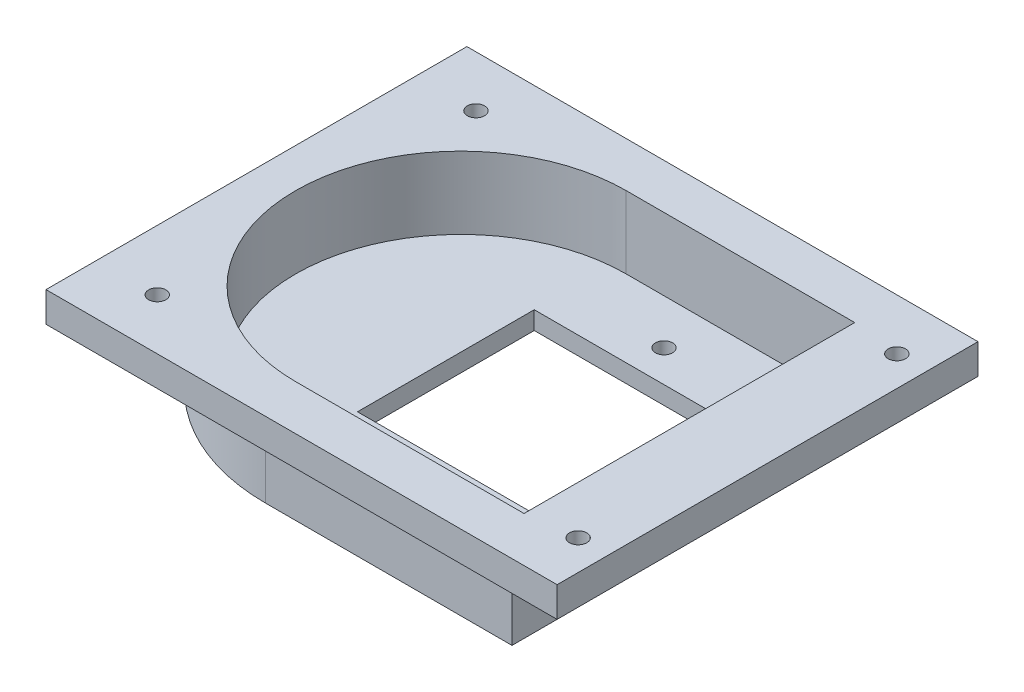
ISO-10303-21;
HEADER;
FILE_DESCRIPTION(('STEP AP214'),'2;1');
FILE_NAME('part.step','',(''),(''),'','','');
FILE_SCHEMA(('AUTOMOTIVE_DESIGN { 1 0 10303 214 1 1 1 1 }'));
ENDSEC;
DATA;
#1=APPLICATION_CONTEXT('core data for automotive mechanical design processes');
#2=APPLICATION_PROTOCOL_DEFINITION('international standard','automotive_design',2000,#1);
#3=PRODUCT_CONTEXT('',#1,'mechanical');
#4=PRODUCT('Part','Part','',(#3));
#5=PRODUCT_RELATED_PRODUCT_CATEGORY('part','',(#4));
#6=PRODUCT_DEFINITION_FORMATION('','',#4);
#7=PRODUCT_DEFINITION_CONTEXT('part definition',#1,'design');
#8=PRODUCT_DEFINITION('design','',#6,#7);
#9=PRODUCT_DEFINITION_SHAPE('','',#8);
#10=(LENGTH_UNIT() NAMED_UNIT(*) SI_UNIT(.MILLI.,.METRE.));
#11=(NAMED_UNIT(*) PLANE_ANGLE_UNIT() SI_UNIT($,.RADIAN.));
#12=(NAMED_UNIT(*) SI_UNIT($,.STERADIAN.) SOLID_ANGLE_UNIT());
#13=UNCERTAINTY_MEASURE_WITH_UNIT(LENGTH_MEASURE(1.E-05),#10,'distance_accuracy_value','');
#14=(GEOMETRIC_REPRESENTATION_CONTEXT(3) GLOBAL_UNCERTAINTY_ASSIGNED_CONTEXT((#13)) GLOBAL_UNIT_ASSIGNED_CONTEXT((#10,
#11,#12)) REPRESENTATION_CONTEXT('',''));
#15=CARTESIAN_POINT('',(0.,0.,0.));
#16=DIRECTION('',(0.,0.,1.));
#17=DIRECTION('',(1.,0.,0.));
#18=AXIS2_PLACEMENT_3D('',#15,#16,#17);
#19=CARTESIAN_POINT('',(0.,0.,0.));
#20=DIRECTION('',(0.,1.,0.));
#21=DIRECTION('',(0.,0.,1.));
#22=AXIS2_PLACEMENT_3D('',#19,#20,#21);
#23=PLANE('',#22);
#24=CARTESIAN_POINT('',(37.5,0.,26.5));
#25=DIRECTION('',(0.,-1.,0.));
#26=DIRECTION('',(0.,0.,-1.));
#27=AXIS2_PLACEMENT_3D('',#24,#25,#26);
#28=CIRCLE('',#27,1.435);
#29=CARTESIAN_POINT('',(37.5,0.,25.065));
#30=VERTEX_POINT('',#29);
#31=EDGE_CURVE('E305',#30,#30,#28,.T.);
#32=ORIENTED_EDGE('',*,*,#31,.F.);
#33=EDGE_LOOP('',(#32));
#34=FACE_BOUND('',#33,.T.);
#35=CARTESIAN_POINT('',(37.5,0.,-26.5));
#36=DIRECTION('',(0.,-1.,0.));
#37=DIRECTION('',(0.,0.,-1.));
#38=AXIS2_PLACEMENT_3D('',#35,#36,#37);
#39=CIRCLE('',#38,1.435);
#40=CARTESIAN_POINT('',(37.5,0.,-27.935));
#41=VERTEX_POINT('',#40);
#42=EDGE_CURVE('E299',#41,#41,#39,.T.);
#43=ORIENTED_EDGE('',*,*,#42,.F.);
#44=EDGE_LOOP('',(#43));
#45=FACE_BOUND('',#44,.T.);
#46=CARTESIAN_POINT('',(-32.5,0.,-26.5));
#47=DIRECTION('',(0.,-1.,0.));
#48=DIRECTION('',(0.,0.,-1.));
#49=AXIS2_PLACEMENT_3D('',#46,#47,#48);
#50=CIRCLE('',#49,1.435);
#51=CARTESIAN_POINT('',(-32.5,0.,-27.935));
#52=VERTEX_POINT('',#51);
#53=EDGE_CURVE('E293',#52,#52,#50,.T.);
#54=ORIENTED_EDGE('',*,*,#53,.F.);
#55=EDGE_LOOP('',(#54));
#56=FACE_BOUND('',#55,.T.);
#57=CARTESIAN_POINT('',(-32.5,0.,26.5));
#58=DIRECTION('',(0.,-1.,0.));
#59=DIRECTION('',(0.,0.,-1.));
#60=AXIS2_PLACEMENT_3D('',#57,#58,#59);
#61=CIRCLE('',#60,1.435);
#62=CARTESIAN_POINT('',(-32.5,0.,25.065));
#63=VERTEX_POINT('',#62);
#64=EDGE_CURVE('E287',#63,#63,#61,.T.);
#65=ORIENTED_EDGE('',*,*,#64,.F.);
#66=EDGE_LOOP('',(#65));
#67=FACE_BOUND('',#66,.T.);
#68=DIRECTION('',(0.,0.,-1.));
#69=VECTOR('',#68,1.);
#70=CARTESIAN_POINT('',(42.5,0.,-35.));
#71=LINE('',#70,#69);
#72=CARTESIAN_POINT('',(42.5,0.,35.));
#73=VERTEX_POINT('',#72);
#74=CARTESIAN_POINT('',(42.5,0.,-35.));
#75=VERTEX_POINT('',#74);
#76=EDGE_CURVE('E240',#73,#75,#71,.T.);
#77=ORIENTED_EDGE('',*,*,#76,.F.);
#78=DIRECTION('',(1.,0.,0.));
#79=VECTOR('',#78,1.);
#80=CARTESIAN_POINT('',(-42.5,0.,35.));
#81=LINE('',#80,#79);
#82=CARTESIAN_POINT('',(-42.5,0.,35.));
#83=VERTEX_POINT('',#82);
#84=EDGE_CURVE('E245',#83,#73,#81,.T.);
#85=ORIENTED_EDGE('',*,*,#84,.F.);
#86=DIRECTION('',(0.,0.,1.));
#87=VECTOR('',#86,1.);
#88=CARTESIAN_POINT('',(-42.5,0.,-35.));
#89=LINE('',#88,#87);
#90=CARTESIAN_POINT('',(-42.5,0.,-35.));
#91=VERTEX_POINT('',#90);
#92=EDGE_CURVE('E256',#91,#83,#89,.T.);
#93=ORIENTED_EDGE('',*,*,#92,.F.);
#94=DIRECTION('',(-1.,0.,0.));
#95=VECTOR('',#94,1.);
#96=CARTESIAN_POINT('',(-42.5,0.,-35.));
#97=LINE('',#96,#95);
#98=EDGE_CURVE('E254',#75,#91,#97,.T.);
#99=ORIENTED_EDGE('',*,*,#98,.F.);
#100=EDGE_LOOP('',(#77,#85,#93,#99));
#101=FACE_BOUND('',#100,.T.);
#102=DIRECTION('',(-1.,0.,0.));
#103=VECTOR('',#102,1.);
#104=CARTESIAN_POINT('',(32.5,0.,32.5));
#105=LINE('',#104,#103);
#106=CARTESIAN_POINT('',(32.5,0.,32.5));
#107=VERTEX_POINT('',#106);
#108=CARTESIAN_POINT('',(-8.49999999999999,0.,32.5));
#109=VERTEX_POINT('',#108);
#110=EDGE_CURVE('E200',#107,#109,#105,.T.);
#111=ORIENTED_EDGE('',*,*,#110,.F.);
#112=DIRECTION('',(0.,0.,1.));
#113=VECTOR('',#112,1.);
#114=CARTESIAN_POINT('',(32.5,0.,-32.5));
#115=LINE('',#114,#113);
#116=CARTESIAN_POINT('',(32.5,0.,-32.5));
#117=VERTEX_POINT('',#116);
#118=EDGE_CURVE('E212',#117,#107,#115,.T.);
#119=ORIENTED_EDGE('',*,*,#118,.F.);
#120=DIRECTION('',(1.,0.,0.));
#121=VECTOR('',#120,1.);
#122=CARTESIAN_POINT('',(-8.49999999999999,0.,-32.5));
#123=LINE('',#122,#121);
#124=CARTESIAN_POINT('',(-8.49999999999999,0.,-32.5));
#125=VERTEX_POINT('',#124);
#126=EDGE_CURVE('E224',#125,#117,#123,.T.);
#127=ORIENTED_EDGE('',*,*,#126,.F.);
#128=CARTESIAN_POINT('',(-8.49999999999999,0.,0.));
#129=DIRECTION('',(0.,-1.,0.));
#130=DIRECTION('',(0.,0.,-1.));
#131=AXIS2_PLACEMENT_3D('',#128,#129,#130);
#132=CIRCLE('',#131,32.5);
#133=EDGE_CURVE('E221',#109,#125,#132,.T.);
#134=ORIENTED_EDGE('',*,*,#133,.F.);
#135=EDGE_LOOP('',(#111,#119,#127,#134));
#136=FACE_BOUND('',#135,.T.);
#137=ADVANCED_FACE('F33',(#34,#45,#56,#67,#101,#136),#23,.F.);
#138=CARTESIAN_POINT('',(42.5,5.,-35.));
#139=DIRECTION('',(-1.,0.,0.));
#140=DIRECTION('',(0.,0.,1.));
#141=AXIS2_PLACEMENT_3D('',#138,#139,#140);
#142=PLANE('',#141);
#143=ORIENTED_EDGE('',*,*,#76,.T.);
#144=DIRECTION('',(0.,-1.,0.));
#145=VECTOR('',#144,1.);
#146=CARTESIAN_POINT('',(42.5,5.,-35.));
#147=LINE('',#146,#145);
#148=CARTESIAN_POINT('',(42.5,5.,-35.));
#149=VERTEX_POINT('',#148);
#150=EDGE_CURVE('E267',#149,#75,#147,.T.);
#151=ORIENTED_EDGE('',*,*,#150,.F.);
#152=DIRECTION('',(0.,0.,-1.));
#153=VECTOR('',#152,1.);
#154=CARTESIAN_POINT('',(42.5,5.,-35.));
#155=LINE('',#154,#153);
#156=CARTESIAN_POINT('',(42.5,5.,35.));
#157=VERTEX_POINT('',#156);
#158=EDGE_CURVE('E241',#157,#149,#155,.T.);
#159=ORIENTED_EDGE('',*,*,#158,.F.);
#160=DIRECTION('',(0.,-1.,0.));
#161=VECTOR('',#160,1.);
#162=CARTESIAN_POINT('',(42.5,5.,35.));
#163=LINE('',#162,#161);
#164=EDGE_CURVE('E251',#157,#73,#163,.T.);
#165=ORIENTED_EDGE('',*,*,#164,.T.);
#166=EDGE_LOOP('',(#143,#151,#159,#165));
#167=FACE_BOUND('',#166,.T.);
#168=ADVANCED_FACE('F35',(#167),#142,.F.);
#169=CARTESIAN_POINT('',(-42.5,5.,-35.));
#170=DIRECTION('',(0.,0.,1.));
#171=DIRECTION('',(1.,0.,0.));
#172=AXIS2_PLACEMENT_3D('',#169,#170,#171);
#173=PLANE('',#172);
#174=ORIENTED_EDGE('',*,*,#98,.T.);
#175=DIRECTION('',(0.,-1.,0.));
#176=VECTOR('',#175,1.);
#177=CARTESIAN_POINT('',(-42.5,5.,-35.));
#178=LINE('',#177,#176);
#179=CARTESIAN_POINT('',(-42.5,5.,-35.));
#180=VERTEX_POINT('',#179);
#181=EDGE_CURVE('E264',#180,#91,#178,.T.);
#182=ORIENTED_EDGE('',*,*,#181,.F.);
#183=DIRECTION('',(-1.,0.,0.));
#184=VECTOR('',#183,1.);
#185=CARTESIAN_POINT('',(-42.5,5.,-35.));
#186=LINE('',#185,#184);
#187=EDGE_CURVE('E244',#149,#180,#186,.T.);
#188=ORIENTED_EDGE('',*,*,#187,.F.);
#189=ORIENTED_EDGE('',*,*,#150,.T.);
#190=EDGE_LOOP('',(#174,#182,#188,#189));
#191=FACE_BOUND('',#190,.T.);
#192=ADVANCED_FACE('F366',(#191),#173,.F.);
#193=CARTESIAN_POINT('',(-42.5,5.,-35.));
#194=DIRECTION('',(1.,0.,0.));
#195=DIRECTION('',(0.,0.,-1.));
#196=AXIS2_PLACEMENT_3D('',#193,#194,#195);
#197=PLANE('',#196);
#198=ORIENTED_EDGE('',*,*,#92,.T.);
#199=DIRECTION('',(0.,-1.,0.));
#200=VECTOR('',#199,1.);
#201=CARTESIAN_POINT('',(-42.5,5.,35.));
#202=LINE('',#201,#200);
#203=CARTESIAN_POINT('',(-42.5,5.,35.));
#204=VERTEX_POINT('',#203);
#205=EDGE_CURVE('E261',#204,#83,#202,.T.);
#206=ORIENTED_EDGE('',*,*,#205,.F.);
#207=DIRECTION('',(0.,0.,1.));
#208=VECTOR('',#207,1.);
#209=CARTESIAN_POINT('',(-42.5,5.,-35.));
#210=LINE('',#209,#208);
#211=EDGE_CURVE('E247',#180,#204,#210,.T.);
#212=ORIENTED_EDGE('',*,*,#211,.F.);
#213=ORIENTED_EDGE('',*,*,#181,.T.);
#214=EDGE_LOOP('',(#198,#206,#212,#213));
#215=FACE_BOUND('',#214,.T.);
#216=ADVANCED_FACE('F363',(#215),#197,.F.);
#217=CARTESIAN_POINT('',(-42.5,5.,35.));
#218=DIRECTION('',(0.,0.,-1.));
#219=DIRECTION('',(-1.,0.,0.));
#220=AXIS2_PLACEMENT_3D('',#217,#218,#219);
#221=PLANE('',#220);
#222=ORIENTED_EDGE('',*,*,#84,.T.);
#223=ORIENTED_EDGE('',*,*,#164,.F.);
#224=DIRECTION('',(1.,0.,0.));
#225=VECTOR('',#224,1.);
#226=CARTESIAN_POINT('',(-42.5,5.,35.));
#227=LINE('',#226,#225);
#228=EDGE_CURVE('E249',#204,#157,#227,.T.);
#229=ORIENTED_EDGE('',*,*,#228,.F.);
#230=ORIENTED_EDGE('',*,*,#205,.T.);
#231=EDGE_LOOP('',(#222,#223,#229,#230));
#232=FACE_BOUND('',#231,.T.);
#233=ADVANCED_FACE('F359',(#232),#221,.F.);
#234=CARTESIAN_POINT('',(0.,5.,0.));
#235=DIRECTION('',(0.,1.,0.));
#236=DIRECTION('',(0.,0.,1.));
#237=AXIS2_PLACEMENT_3D('',#234,#235,#236);
#238=PLANE('',#237);
#239=CARTESIAN_POINT('',(37.5,5.,26.5));
#240=DIRECTION('',(0.,-1.,0.));
#241=DIRECTION('',(0.,0.,-1.));
#242=AXIS2_PLACEMENT_3D('',#239,#240,#241);
#243=CIRCLE('',#242,1.435);
#244=CARTESIAN_POINT('',(37.5,5.,25.065));
#245=VERTEX_POINT('',#244);
#246=EDGE_CURVE('E290',#245,#245,#243,.T.);
#247=ORIENTED_EDGE('',*,*,#246,.T.);
#248=EDGE_LOOP('',(#247));
#249=FACE_BOUND('',#248,.T.);
#250=CARTESIAN_POINT('',(37.5,5.,-26.5));
#251=DIRECTION('',(0.,-1.,0.));
#252=DIRECTION('',(0.,0.,-1.));
#253=AXIS2_PLACEMENT_3D('',#250,#251,#252);
#254=CIRCLE('',#253,1.435);
#255=CARTESIAN_POINT('',(37.5,5.,-27.935));
#256=VERTEX_POINT('',#255);
#257=EDGE_CURVE('E302',#256,#256,#254,.T.);
#258=ORIENTED_EDGE('',*,*,#257,.T.);
#259=EDGE_LOOP('',(#258));
#260=FACE_BOUND('',#259,.T.);
#261=CARTESIAN_POINT('',(-32.5,5.,-26.5));
#262=DIRECTION('',(0.,-1.,0.));
#263=DIRECTION('',(0.,0.,-1.));
#264=AXIS2_PLACEMENT_3D('',#261,#262,#263);
#265=CIRCLE('',#264,1.435);
#266=CARTESIAN_POINT('',(-32.5,5.,-27.935));
#267=VERTEX_POINT('',#266);
#268=EDGE_CURVE('E296',#267,#267,#265,.T.);
#269=ORIENTED_EDGE('',*,*,#268,.T.);
#270=EDGE_LOOP('',(#269));
#271=FACE_BOUND('',#270,.T.);
#272=CARTESIAN_POINT('',(-32.5,5.,26.5));
#273=DIRECTION('',(0.,-1.,0.));
#274=DIRECTION('',(0.,0.,-1.));
#275=AXIS2_PLACEMENT_3D('',#272,#273,#274);
#276=CIRCLE('',#275,1.435);
#277=CARTESIAN_POINT('',(-32.5,5.,25.065));
#278=VERTEX_POINT('',#277);
#279=EDGE_CURVE('E286',#278,#278,#276,.T.);
#280=ORIENTED_EDGE('',*,*,#279,.T.);
#281=EDGE_LOOP('',(#280));
#282=FACE_BOUND('',#281,.T.);
#283=DIRECTION('',(1.,0.,0.));
#284=VECTOR('',#283,1.);
#285=CARTESIAN_POINT('',(29.5,5.,27.5));
#286=LINE('',#285,#284);
#287=CARTESIAN_POINT('',(-8.49999999999999,5.,27.5));
#288=VERTEX_POINT('',#287);
#289=CARTESIAN_POINT('',(29.5,5.,27.5));
#290=VERTEX_POINT('',#289);
#291=EDGE_CURVE('E172',#288,#290,#286,.T.);
#292=ORIENTED_EDGE('',*,*,#291,.F.);
#293=CARTESIAN_POINT('',(-8.49999999999999,5.,0.));
#294=DIRECTION('',(0.,1.,0.));
#295=DIRECTION('',(0.,0.,1.));
#296=AXIS2_PLACEMENT_3D('',#293,#294,#295);
#297=CIRCLE('',#296,27.5);
#298=CARTESIAN_POINT('',(-8.49999999999999,5.,-27.5));
#299=VERTEX_POINT('',#298);
#300=EDGE_CURVE('E179',#299,#288,#297,.T.);
#301=ORIENTED_EDGE('',*,*,#300,.F.);
#302=DIRECTION('',(-1.,0.,0.));
#303=VECTOR('',#302,1.);
#304=CARTESIAN_POINT('',(-8.49999999999999,5.,-27.5));
#305=LINE('',#304,#303);
#306=CARTESIAN_POINT('',(29.5,5.,-27.5));
#307=VERTEX_POINT('',#306);
#308=EDGE_CURVE('E193',#307,#299,#305,.T.);
#309=ORIENTED_EDGE('',*,*,#308,.F.);
#310=DIRECTION('',(0.,0.,-1.));
#311=VECTOR('',#310,1.);
#312=CARTESIAN_POINT('',(29.5,5.,-27.5));
#313=LINE('',#312,#311);
#314=EDGE_CURVE('E191',#290,#307,#313,.T.);
#315=ORIENTED_EDGE('',*,*,#314,.F.);
#316=EDGE_LOOP('',(#292,#301,#309,#315));
#317=FACE_BOUND('',#316,.T.);
#318=ORIENTED_EDGE('',*,*,#158,.T.);
#319=ORIENTED_EDGE('',*,*,#187,.T.);
#320=ORIENTED_EDGE('',*,*,#211,.T.);
#321=ORIENTED_EDGE('',*,*,#228,.T.);
#322=EDGE_LOOP('',(#318,#319,#320,#321));
#323=FACE_BOUND('',#322,.T.);
#324=ADVANCED_FACE('F311',(#249,#260,#271,#282,#317,#323),#238,.T.);
#325=CARTESIAN_POINT('',(32.5,-10.,32.5));
#326=DIRECTION('',(0.,0.,-1.));
#327=DIRECTION('',(-1.,0.,0.));
#328=AXIS2_PLACEMENT_3D('',#325,#326,#327);
#329=PLANE('',#328);
#330=ORIENTED_EDGE('',*,*,#110,.T.);
#331=DIRECTION('',(0.,1.,0.));
#332=VECTOR('',#331,1.);
#333=CARTESIAN_POINT('',(-8.49999999999998,-10.,32.5));
#334=LINE('',#333,#332);
#335=CARTESIAN_POINT('',(-8.49999999999998,-10.,32.5));
#336=VERTEX_POINT('',#335);
#337=EDGE_CURVE('E237',#336,#109,#334,.T.);
#338=ORIENTED_EDGE('',*,*,#337,.F.);
#339=DIRECTION('',(-1.,0.,0.));
#340=VECTOR('',#339,1.);
#341=CARTESIAN_POINT('',(32.5,-10.,32.5));
#342=LINE('',#341,#340);
#343=CARTESIAN_POINT('',(32.5,-10.,32.5));
#344=VERTEX_POINT('',#343);
#345=EDGE_CURVE('E208',#344,#336,#342,.T.);
#346=ORIENTED_EDGE('',*,*,#345,.F.);
#347=DIRECTION('',(0.,1.,0.));
#348=VECTOR('',#347,1.);
#349=CARTESIAN_POINT('',(32.5,-10.,32.5));
#350=LINE('',#349,#348);
#351=EDGE_CURVE('E218',#344,#107,#350,.T.);
#352=ORIENTED_EDGE('',*,*,#351,.T.);
#353=EDGE_LOOP('',(#330,#338,#346,#352));
#354=FACE_BOUND('',#353,.T.);
#355=ADVANCED_FACE('F341',(#354),#329,.F.);
#356=CARTESIAN_POINT('',(-8.49999999999999,-10.,0.));
#357=DIRECTION('',(0.,1.,0.));
#358=DIRECTION('',(0.,0.,1.));
#359=AXIS2_PLACEMENT_3D('',#356,#357,#358);
#360=CYLINDRICAL_SURFACE('',#359,32.5);
#361=ORIENTED_EDGE('',*,*,#133,.T.);
#362=DIRECTION('',(0.,1.,0.));
#363=VECTOR('',#362,1.);
#364=CARTESIAN_POINT('',(-8.49999999999999,-10.,-32.5));
#365=LINE('',#364,#363);
#366=CARTESIAN_POINT('',(-8.49999999999999,-10.,-32.5));
#367=VERTEX_POINT('',#366);
#368=EDGE_CURVE('E234',#367,#125,#365,.T.);
#369=ORIENTED_EDGE('',*,*,#368,.F.);
#370=CARTESIAN_POINT('',(-8.49999999999999,-10.,0.));
#371=DIRECTION('',(0.,-1.,0.));
#372=DIRECTION('',(0.,0.,-1.));
#373=AXIS2_PLACEMENT_3D('',#370,#371,#372);
#374=CIRCLE('',#373,32.5);
#375=EDGE_CURVE('E211',#336,#367,#374,.T.);
#376=ORIENTED_EDGE('',*,*,#375,.F.);
#377=ORIENTED_EDGE('',*,*,#337,.T.);
#378=EDGE_LOOP('',(#361,#369,#376,#377));
#379=FACE_BOUND('',#378,.T.);
#380=ADVANCED_FACE('F347',(#379),#360,.T.);
#381=CARTESIAN_POINT('',(-8.49999999999999,-10.,-32.5));
#382=DIRECTION('',(0.,0.,1.));
#383=DIRECTION('',(1.,0.,0.));
#384=AXIS2_PLACEMENT_3D('',#381,#382,#383);
#385=PLANE('',#384);
#386=ORIENTED_EDGE('',*,*,#126,.T.);
#387=DIRECTION('',(0.,1.,0.));
#388=VECTOR('',#387,1.);
#389=CARTESIAN_POINT('',(32.5,-10.,-32.5));
#390=LINE('',#389,#388);
#391=CARTESIAN_POINT('',(32.5,-10.,-32.5));
#392=VERTEX_POINT('',#391);
#393=EDGE_CURVE('E231',#392,#117,#390,.T.);
#394=ORIENTED_EDGE('',*,*,#393,.F.);
#395=DIRECTION('',(1.,0.,0.));
#396=VECTOR('',#395,1.);
#397=CARTESIAN_POINT('',(-8.49999999999999,-10.,-32.5));
#398=LINE('',#397,#396);
#399=EDGE_CURVE('E214',#367,#392,#398,.T.);
#400=ORIENTED_EDGE('',*,*,#399,.F.);
#401=ORIENTED_EDGE('',*,*,#368,.T.);
#402=EDGE_LOOP('',(#386,#394,#400,#401));
#403=FACE_BOUND('',#402,.T.);
#404=ADVANCED_FACE('F345',(#403),#385,.F.);
#405=CARTESIAN_POINT('',(32.5,-10.,-32.5));
#406=DIRECTION('',(-1.,0.,0.));
#407=DIRECTION('',(0.,0.,1.));
#408=AXIS2_PLACEMENT_3D('',#405,#406,#407);
#409=PLANE('',#408);
#410=ORIENTED_EDGE('',*,*,#118,.T.);
#411=ORIENTED_EDGE('',*,*,#351,.F.);
#412=DIRECTION('',(0.,0.,1.));
#413=VECTOR('',#412,1.);
#414=CARTESIAN_POINT('',(32.5,-10.,-32.5));
#415=LINE('',#414,#413);
#416=EDGE_CURVE('E216',#392,#344,#415,.T.);
#417=ORIENTED_EDGE('',*,*,#416,.F.);
#418=ORIENTED_EDGE('',*,*,#393,.T.);
#419=EDGE_LOOP('',(#410,#411,#417,#418));
#420=FACE_BOUND('',#419,.T.);
#421=ADVANCED_FACE('F337',(#420),#409,.F.);
#422=CARTESIAN_POINT('',(-8.49999999999999,-10.,0.));
#423=DIRECTION('',(0.,-1.,0.));
#424=DIRECTION('',(0.,0.,-1.));
#425=AXIS2_PLACEMENT_3D('',#422,#423,#424);
#426=PLANE('',#425);
#427=CARTESIAN_POINT('',(5.28000000000002,-10.,-20.));
#428=DIRECTION('',(0.,-1.,0.));
#429=DIRECTION('',(0.,0.,1.));
#430=AXIS2_PLACEMENT_3D('',#427,#428,#429);
#431=CIRCLE('',#430,1.435);
#432=CARTESIAN_POINT('',(5.28000000000002,-10.,-18.565));
#433=VERTEX_POINT('',#432);
#434=EDGE_CURVE('E282',#433,#433,#431,.T.);
#435=ORIENTED_EDGE('',*,*,#434,.F.);
#436=EDGE_LOOP('',(#435));
#437=FACE_BOUND('',#436,.T.);
#438=CARTESIAN_POINT('',(5.28000000000001,-10.,20.));
#439=DIRECTION('',(0.,-1.,0.));
#440=DIRECTION('',(0.,0.,-1.));
#441=AXIS2_PLACEMENT_3D('',#438,#439,#440);
#442=CIRCLE('',#441,1.435);
#443=CARTESIAN_POINT('',(5.28000000000001,-10.,18.565));
#444=VERTEX_POINT('',#443);
#445=EDGE_CURVE('E274',#444,#444,#442,.T.);
#446=ORIENTED_EDGE('',*,*,#445,.F.);
#447=EDGE_LOOP('',(#446));
#448=FACE_BOUND('',#447,.T.);
#449=DIRECTION('',(0.,0.,1.));
#450=VECTOR('',#449,1.);
#451=CARTESIAN_POINT('',(29.5,-10.,-14.7));
#452=LINE('',#451,#450);
#453=CARTESIAN_POINT('',(29.5,-10.,-14.7));
#454=VERTEX_POINT('',#453);
#455=CARTESIAN_POINT('',(29.5,-10.,14.7));
#456=VERTEX_POINT('',#455);
#457=EDGE_CURVE('E50',#454,#456,#452,.T.);
#458=ORIENTED_EDGE('',*,*,#457,.F.);
#459=DIRECTION('',(1.,0.,0.));
#460=VECTOR('',#459,1.);
#461=CARTESIAN_POINT('',(-11.,-10.,-14.7));
#462=LINE('',#461,#460);
#463=CARTESIAN_POINT('',(-11.,-10.,-14.7));
#464=VERTEX_POINT('',#463);
#465=EDGE_CURVE('E165',#464,#454,#462,.T.);
#466=ORIENTED_EDGE('',*,*,#465,.F.);
#467=DIRECTION('',(0.,0.,-1.));
#468=VECTOR('',#467,1.);
#469=CARTESIAN_POINT('',(-11.,-10.,-14.7));
#470=LINE('',#469,#468);
#471=CARTESIAN_POINT('',(-11.,-10.,14.7));
#472=VERTEX_POINT('',#471);
#473=EDGE_CURVE('E150',#472,#464,#470,.T.);
#474=ORIENTED_EDGE('',*,*,#473,.F.);
#475=DIRECTION('',(-1.,0.,0.));
#476=VECTOR('',#475,1.);
#477=CARTESIAN_POINT('',(-11.,-10.,14.7));
#478=LINE('',#477,#476);
#479=EDGE_CURVE('E158',#456,#472,#478,.T.);
#480=ORIENTED_EDGE('',*,*,#479,.F.);
#481=EDGE_LOOP('',(#458,#466,#474,#480));
#482=FACE_BOUND('',#481,.T.);
#483=ORIENTED_EDGE('',*,*,#345,.T.);
#484=ORIENTED_EDGE('',*,*,#375,.T.);
#485=ORIENTED_EDGE('',*,*,#399,.T.);
#486=ORIENTED_EDGE('',*,*,#416,.T.);
#487=EDGE_LOOP('',(#483,#484,#485,#486));
#488=FACE_BOUND('',#487,.T.);
#489=ADVANCED_FACE('F162',(#437,#448,#482,#488),#426,.T.);
#490=CARTESIAN_POINT('',(29.5,-7.,27.5));
#491=DIRECTION('',(0.,0.,1.));
#492=DIRECTION('',(1.,0.,0.));
#493=AXIS2_PLACEMENT_3D('',#490,#491,#492);
#494=PLANE('',#493);
#495=ORIENTED_EDGE('',*,*,#291,.T.);
#496=DIRECTION('',(0.,1.,0.));
#497=VECTOR('',#496,1.);
#498=CARTESIAN_POINT('',(29.5,-7.,27.5));
#499=LINE('',#498,#497);
#500=CARTESIAN_POINT('',(29.5,-7.,27.5));
#501=VERTEX_POINT('',#500);
#502=EDGE_CURVE('E189',#501,#290,#499,.T.);
#503=ORIENTED_EDGE('',*,*,#502,.F.);
#504=DIRECTION('',(1.,0.,0.));
#505=VECTOR('',#504,1.);
#506=CARTESIAN_POINT('',(29.5,-7.,27.5));
#507=LINE('',#506,#505);
#508=CARTESIAN_POINT('',(-8.49999999999999,-7.,27.5));
#509=VERTEX_POINT('',#508);
#510=EDGE_CURVE('E175',#509,#501,#507,.T.);
#511=ORIENTED_EDGE('',*,*,#510,.F.);
#512=DIRECTION('',(0.,1.,0.));
#513=VECTOR('',#512,1.);
#514=CARTESIAN_POINT('',(-8.49999999999999,-7.,27.5));
#515=LINE('',#514,#513);
#516=EDGE_CURVE('E198',#509,#288,#515,.T.);
#517=ORIENTED_EDGE('',*,*,#516,.T.);
#518=EDGE_LOOP('',(#495,#503,#511,#517));
#519=FACE_BOUND('',#518,.T.);
#520=ADVANCED_FACE('F467',(#519),#494,.F.);
#521=CARTESIAN_POINT('',(-8.49999999999999,-7.,0.));
#522=DIRECTION('',(0.,1.,0.));
#523=DIRECTION('',(0.,0.,1.));
#524=AXIS2_PLACEMENT_3D('',#521,#522,#523);
#525=CYLINDRICAL_SURFACE('',#524,27.5);
#526=ORIENTED_EDGE('',*,*,#300,.T.);
#527=ORIENTED_EDGE('',*,*,#516,.F.);
#528=CARTESIAN_POINT('',(-8.49999999999999,-7.,0.));
#529=DIRECTION('',(0.,1.,0.));
#530=DIRECTION('',(0.,0.,1.));
#531=AXIS2_PLACEMENT_3D('',#528,#529,#530);
#532=CIRCLE('',#531,27.5);
#533=CARTESIAN_POINT('',(-8.49999999999999,-7.,-27.5));
#534=VERTEX_POINT('',#533);
#535=EDGE_CURVE('E186',#534,#509,#532,.T.);
#536=ORIENTED_EDGE('',*,*,#535,.F.);
#537=DIRECTION('',(0.,1.,0.));
#538=VECTOR('',#537,1.);
#539=CARTESIAN_POINT('',(-8.49999999999999,-7.,-27.5));
#540=LINE('',#539,#538);
#541=EDGE_CURVE('E201',#534,#299,#540,.T.);
#542=ORIENTED_EDGE('',*,*,#541,.T.);
#543=EDGE_LOOP('',(#526,#527,#536,#542));
#544=FACE_BOUND('',#543,.T.);
#545=ADVANCED_FACE('F463',(#544),#525,.F.);
#546=CARTESIAN_POINT('',(-8.49999999999999,-7.,-27.5));
#547=DIRECTION('',(0.,0.,-1.));
#548=DIRECTION('',(-1.,0.,0.));
#549=AXIS2_PLACEMENT_3D('',#546,#547,#548);
#550=PLANE('',#549);
#551=ORIENTED_EDGE('',*,*,#308,.T.);
#552=ORIENTED_EDGE('',*,*,#541,.F.);
#553=DIRECTION('',(-1.,0.,0.));
#554=VECTOR('',#553,1.);
#555=CARTESIAN_POINT('',(-8.49999999999999,-7.,-27.5));
#556=LINE('',#555,#554);
#557=CARTESIAN_POINT('',(29.5,-7.,-27.5));
#558=VERTEX_POINT('',#557);
#559=EDGE_CURVE('E183',#558,#534,#556,.T.);
#560=ORIENTED_EDGE('',*,*,#559,.F.);
#561=DIRECTION('',(0.,1.,0.));
#562=VECTOR('',#561,1.);
#563=CARTESIAN_POINT('',(29.5,-7.,-27.5));
#564=LINE('',#563,#562);
#565=EDGE_CURVE('E203',#558,#307,#564,.T.);
#566=ORIENTED_EDGE('',*,*,#565,.T.);
#567=EDGE_LOOP('',(#551,#552,#560,#566));
#568=FACE_BOUND('',#567,.T.);
#569=ADVANCED_FACE('F466',(#568),#550,.F.);
#570=CARTESIAN_POINT('',(29.5,-7.,-27.5));
#571=DIRECTION('',(1.,0.,0.));
#572=DIRECTION('',(0.,0.,-1.));
#573=AXIS2_PLACEMENT_3D('',#570,#571,#572);
#574=PLANE('',#573);
#575=ORIENTED_EDGE('',*,*,#314,.T.);
#576=ORIENTED_EDGE('',*,*,#565,.F.);
#577=DIRECTION('',(0.,0.,-1.));
#578=VECTOR('',#577,1.);
#579=CARTESIAN_POINT('',(29.5,-7.,-27.5));
#580=LINE('',#579,#578);
#581=CARTESIAN_POINT('',(29.5,-7.,-14.7));
#582=VERTEX_POINT('',#581);
#583=EDGE_CURVE('E178',#582,#558,#580,.T.);
#584=ORIENTED_EDGE('',*,*,#583,.F.);
#585=DIRECTION('',(0.,-1.,0.));
#586=VECTOR('',#585,1.);
#587=CARTESIAN_POINT('',(29.5,5.,-14.7));
#588=LINE('',#587,#586);
#589=EDGE_CURVE('E170',#582,#454,#588,.T.);
#590=ORIENTED_EDGE('',*,*,#589,.T.);
#591=ORIENTED_EDGE('',*,*,#457,.T.);
#592=DIRECTION('',(0.,-1.,0.));
#593=VECTOR('',#592,1.);
#594=CARTESIAN_POINT('',(29.5,5.,14.7));
#595=LINE('',#594,#593);
#596=CARTESIAN_POINT('',(29.5,-7.,14.7));
#597=VERTEX_POINT('',#596);
#598=EDGE_CURVE('E155',#597,#456,#595,.T.);
#599=ORIENTED_EDGE('',*,*,#598,.F.);
#600=EDGE_CURVE('E180',#501,#597,#580,.T.);
#601=ORIENTED_EDGE('',*,*,#600,.F.);
#602=ORIENTED_EDGE('',*,*,#502,.T.);
#603=EDGE_LOOP('',(#575,#576,#584,#590,#591,#599,#601,#602));
#604=FACE_BOUND('',#603,.T.);
#605=ADVANCED_FACE('F461',(#604),#574,.F.);
#606=CARTESIAN_POINT('',(-8.49999999999999,-7.,0.));
#607=DIRECTION('',(0.,1.,0.));
#608=DIRECTION('',(0.,0.,1.));
#609=AXIS2_PLACEMENT_3D('',#606,#607,#608);
#610=PLANE('',#609);
#611=CARTESIAN_POINT('',(5.28000000000002,-7.,-20.));
#612=DIRECTION('',(0.,1.,0.));
#613=DIRECTION('',(0.,0.,1.));
#614=AXIS2_PLACEMENT_3D('',#611,#612,#613);
#615=CIRCLE('',#614,1.435);
#616=CARTESIAN_POINT('',(5.28000000000002,-7.,-18.565));
#617=VERTEX_POINT('',#616);
#618=EDGE_CURVE('E37',#617,#617,#615,.T.);
#619=ORIENTED_EDGE('',*,*,#618,.F.);
#620=EDGE_LOOP('',(#619));
#621=FACE_BOUND('',#620,.T.);
#622=CARTESIAN_POINT('',(5.28000000000001,-7.,20.));
#623=DIRECTION('',(0.,1.,0.));
#624=DIRECTION('',(0.,0.,1.));
#625=AXIS2_PLACEMENT_3D('',#622,#623,#624);
#626=CIRCLE('',#625,1.435);
#627=CARTESIAN_POINT('',(5.28000000000001,-7.,21.435));
#628=VERTEX_POINT('',#627);
#629=EDGE_CURVE('E272',#628,#628,#626,.T.);
#630=ORIENTED_EDGE('',*,*,#629,.F.);
#631=EDGE_LOOP('',(#630));
#632=FACE_BOUND('',#631,.T.);
#633=DIRECTION('',(-1.,0.,0.));
#634=VECTOR('',#633,1.);
#635=CARTESIAN_POINT('',(-8.49999999999999,-7.,-14.7));
#636=LINE('',#635,#634);
#637=CARTESIAN_POINT('',(-11.,-7.,-14.7));
#638=VERTEX_POINT('',#637);
#639=EDGE_CURVE('E11',#582,#638,#636,.T.);
#640=ORIENTED_EDGE('',*,*,#639,.F.);
#641=ORIENTED_EDGE('',*,*,#583,.T.);
#642=ORIENTED_EDGE('',*,*,#559,.T.);
#643=ORIENTED_EDGE('',*,*,#535,.T.);
#644=ORIENTED_EDGE('',*,*,#510,.T.);
#645=ORIENTED_EDGE('',*,*,#600,.T.);
#646=DIRECTION('',(1.,0.,0.));
#647=VECTOR('',#646,1.);
#648=CARTESIAN_POINT('',(-8.49999999999999,-7.,14.7));
#649=LINE('',#648,#647);
#650=CARTESIAN_POINT('',(-11.,-7.,14.7));
#651=VERTEX_POINT('',#650);
#652=EDGE_CURVE('E270',#651,#597,#649,.T.);
#653=ORIENTED_EDGE('',*,*,#652,.F.);
#654=DIRECTION('',(0.,0.,1.));
#655=VECTOR('',#654,1.);
#656=CARTESIAN_POINT('',(-11.,-7.,0.));
#657=LINE('',#656,#655);
#658=EDGE_CURVE('E42',#638,#651,#657,.T.);
#659=ORIENTED_EDGE('',*,*,#658,.F.);
#660=EDGE_LOOP('',(#640,#641,#642,#643,#644,#645,#653,#659));
#661=FACE_BOUND('',#660,.T.);
#662=ADVANCED_FACE('F453',(#621,#632,#661),#610,.T.);
#663=CARTESIAN_POINT('',(-11.,5.,-14.7));
#664=DIRECTION('',(0.,0.,-1.));
#665=DIRECTION('',(-1.,0.,0.));
#666=AXIS2_PLACEMENT_3D('',#663,#664,#665);
#667=PLANE('',#666);
#668=ORIENTED_EDGE('',*,*,#639,.T.);
#669=DIRECTION('',(0.,-1.,0.));
#670=VECTOR('',#669,1.);
#671=CARTESIAN_POINT('',(-11.,5.,-14.7));
#672=LINE('',#671,#670);
#673=EDGE_CURVE('E154',#638,#464,#672,.T.);
#674=ORIENTED_EDGE('',*,*,#673,.T.);
#675=ORIENTED_EDGE('',*,*,#465,.T.);
#676=ORIENTED_EDGE('',*,*,#589,.F.);
#677=EDGE_LOOP('',(#668,#674,#675,#676));
#678=FACE_BOUND('',#677,.T.);
#679=ADVANCED_FACE('F450',(#678),#667,.F.);
#680=CARTESIAN_POINT('',(-11.,5.,-14.7));
#681=DIRECTION('',(-1.,0.,0.));
#682=DIRECTION('',(0.,0.,1.));
#683=AXIS2_PLACEMENT_3D('',#680,#681,#682);
#684=PLANE('',#683);
#685=ORIENTED_EDGE('',*,*,#658,.T.);
#686=DIRECTION('',(0.,-1.,0.));
#687=VECTOR('',#686,1.);
#688=CARTESIAN_POINT('',(-11.,5.,14.7));
#689=LINE('',#688,#687);
#690=EDGE_CURVE('E58',#651,#472,#689,.T.);
#691=ORIENTED_EDGE('',*,*,#690,.T.);
#692=ORIENTED_EDGE('',*,*,#473,.T.);
#693=ORIENTED_EDGE('',*,*,#673,.F.);
#694=EDGE_LOOP('',(#685,#691,#692,#693));
#695=FACE_BOUND('',#694,.T.);
#696=ADVANCED_FACE('F147',(#695),#684,.F.);
#697=CARTESIAN_POINT('',(-11.,5.,14.7));
#698=DIRECTION('',(0.,0.,1.));
#699=DIRECTION('',(1.,0.,0.));
#700=AXIS2_PLACEMENT_3D('',#697,#698,#699);
#701=PLANE('',#700);
#702=ORIENTED_EDGE('',*,*,#652,.T.);
#703=ORIENTED_EDGE('',*,*,#598,.T.);
#704=ORIENTED_EDGE('',*,*,#479,.T.);
#705=ORIENTED_EDGE('',*,*,#690,.F.);
#706=EDGE_LOOP('',(#702,#703,#704,#705));
#707=FACE_BOUND('',#706,.T.);
#708=ADVANCED_FACE('F159',(#707),#701,.F.);
#709=CARTESIAN_POINT('',(5.28000000000001,5.,20.));
#710=DIRECTION('',(0.,-1.,0.));
#711=DIRECTION('',(0.,0.,-1.));
#712=AXIS2_PLACEMENT_3D('',#709,#710,#711);
#713=CYLINDRICAL_SURFACE('',#712,1.435);
#714=ORIENTED_EDGE('',*,*,#629,.T.);
#715=EDGE_LOOP('',(#714));
#716=FACE_BOUND('',#715,.T.);
#717=ORIENTED_EDGE('',*,*,#445,.T.);
#718=EDGE_LOOP('',(#717));
#719=FACE_BOUND('',#718,.T.);
#720=ADVANCED_FACE('F446',(#716,#719),#713,.F.);
#721=CARTESIAN_POINT('',(5.28000000000002,5.,-20.));
#722=DIRECTION('',(0.,-1.,0.));
#723=DIRECTION('',(0.,0.,-1.));
#724=AXIS2_PLACEMENT_3D('',#721,#722,#723);
#725=CYLINDRICAL_SURFACE('',#724,1.435);
#726=ORIENTED_EDGE('',*,*,#618,.T.);
#727=EDGE_LOOP('',(#726));
#728=FACE_BOUND('',#727,.T.);
#729=ORIENTED_EDGE('',*,*,#434,.T.);
#730=EDGE_LOOP('',(#729));
#731=FACE_BOUND('',#730,.T.);
#732=ADVANCED_FACE('F397',(#728,#731),#725,.F.);
#733=CARTESIAN_POINT('',(-32.5,5.,26.5));
#734=DIRECTION('',(0.,-1.,0.));
#735=DIRECTION('',(0.,0.,-1.));
#736=AXIS2_PLACEMENT_3D('',#733,#734,#735);
#737=CYLINDRICAL_SURFACE('',#736,1.435);
#738=ORIENTED_EDGE('',*,*,#279,.F.);
#739=EDGE_LOOP('',(#738));
#740=FACE_BOUND('',#739,.T.);
#741=ORIENTED_EDGE('',*,*,#64,.T.);
#742=EDGE_LOOP('',(#741));
#743=FACE_BOUND('',#742,.T.);
#744=ADVANCED_FACE('F408',(#740,#743),#737,.F.);
#745=CARTESIAN_POINT('',(-32.5,5.,-26.5));
#746=DIRECTION('',(0.,-1.,0.));
#747=DIRECTION('',(0.,0.,-1.));
#748=AXIS2_PLACEMENT_3D('',#745,#746,#747);
#749=CYLINDRICAL_SURFACE('',#748,1.435);
#750=ORIENTED_EDGE('',*,*,#268,.F.);
#751=EDGE_LOOP('',(#750));
#752=FACE_BOUND('',#751,.T.);
#753=ORIENTED_EDGE('',*,*,#53,.T.);
#754=EDGE_LOOP('',(#753));
#755=FACE_BOUND('',#754,.T.);
#756=ADVANCED_FACE('F413',(#752,#755),#749,.F.);
#757=CARTESIAN_POINT('',(37.5,5.,-26.5));
#758=DIRECTION('',(0.,-1.,0.));
#759=DIRECTION('',(0.,0.,-1.));
#760=AXIS2_PLACEMENT_3D('',#757,#758,#759);
#761=CYLINDRICAL_SURFACE('',#760,1.435);
#762=ORIENTED_EDGE('',*,*,#257,.F.);
#763=EDGE_LOOP('',(#762));
#764=FACE_BOUND('',#763,.T.);
#765=ORIENTED_EDGE('',*,*,#42,.T.);
#766=EDGE_LOOP('',(#765));
#767=FACE_BOUND('',#766,.T.);
#768=ADVANCED_FACE('F317',(#764,#767),#761,.F.);
#769=CARTESIAN_POINT('',(37.5,5.,26.5));
#770=DIRECTION('',(0.,-1.,0.));
#771=DIRECTION('',(0.,0.,-1.));
#772=AXIS2_PLACEMENT_3D('',#769,#770,#771);
#773=CYLINDRICAL_SURFACE('',#772,1.435);
#774=ORIENTED_EDGE('',*,*,#246,.F.);
#775=EDGE_LOOP('',(#774));
#776=FACE_BOUND('',#775,.T.);
#777=ORIENTED_EDGE('',*,*,#31,.T.);
#778=EDGE_LOOP('',(#777));
#779=FACE_BOUND('',#778,.T.);
#780=ADVANCED_FACE('F314',(#776,#779),#773,.F.);
#781=CLOSED_SHELL('',(#137,#168,#192,#216,#233,#324,#355,#380,#404,#421,#489,#520,#545,#569,
#605,#662,#679,#696,#708,#720,#732,#744,#756,#768,#780));
#782=MANIFOLD_SOLID_BREP('B2',#781);
#783=ADVANCED_BREP_SHAPE_REPRESENTATION('',(#18,#782),#14);
#784=SHAPE_DEFINITION_REPRESENTATION(#9,#783);
ENDSEC;
END-ISO-10303-21;
